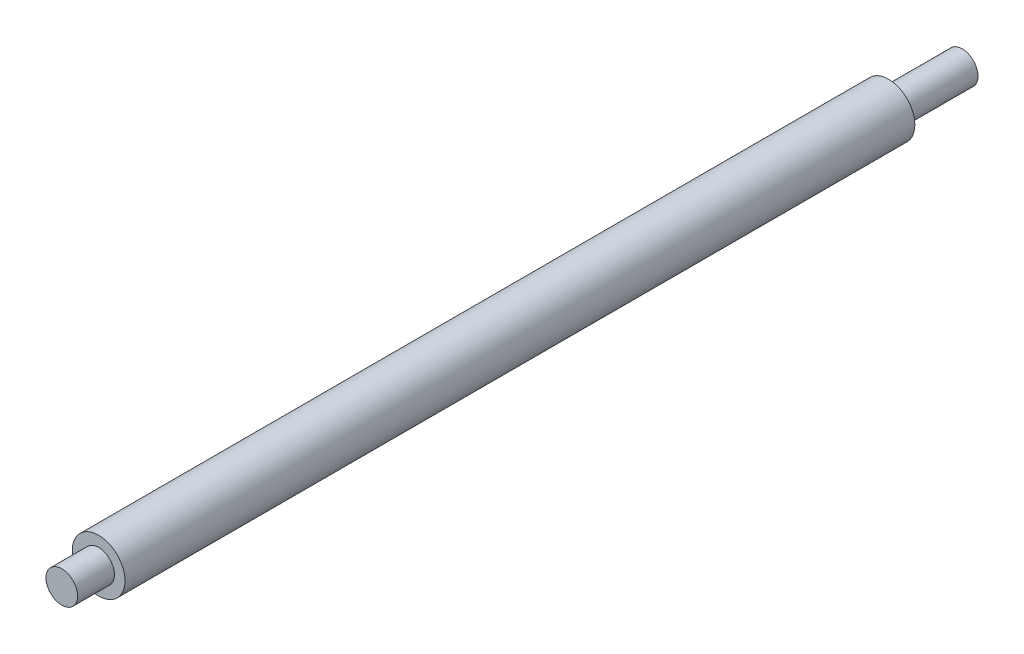
ISO-10303-21;
HEADER;
FILE_DESCRIPTION(('STEP AP214'),'2;1');
FILE_NAME('part.step','',(''),(''),'','','');
FILE_SCHEMA(('AUTOMOTIVE_DESIGN { 1 0 10303 214 1 1 1 1 }'));
ENDSEC;
DATA;
#1=APPLICATION_CONTEXT('core data for automotive mechanical design processes');
#2=APPLICATION_PROTOCOL_DEFINITION('international standard','automotive_design',2000,#1);
#3=PRODUCT_CONTEXT('',#1,'mechanical');
#4=PRODUCT('Part','Part','',(#3));
#5=PRODUCT_RELATED_PRODUCT_CATEGORY('part','',(#4));
#6=PRODUCT_DEFINITION_FORMATION('','',#4);
#7=PRODUCT_DEFINITION_CONTEXT('part definition',#1,'design');
#8=PRODUCT_DEFINITION('design','',#6,#7);
#9=PRODUCT_DEFINITION_SHAPE('','',#8);
#10=(LENGTH_UNIT() NAMED_UNIT(*) SI_UNIT(.MILLI.,.METRE.));
#11=(NAMED_UNIT(*) PLANE_ANGLE_UNIT() SI_UNIT($,.RADIAN.));
#12=(NAMED_UNIT(*) SI_UNIT($,.STERADIAN.) SOLID_ANGLE_UNIT());
#13=UNCERTAINTY_MEASURE_WITH_UNIT(LENGTH_MEASURE(1.E-05),#10,'distance_accuracy_value','');
#14=(GEOMETRIC_REPRESENTATION_CONTEXT(3) GLOBAL_UNCERTAINTY_ASSIGNED_CONTEXT((#13)) GLOBAL_UNIT_ASSIGNED_CONTEXT((#10,
#11,#12)) REPRESENTATION_CONTEXT('',''));
#15=CARTESIAN_POINT('',(0.,0.,0.));
#16=DIRECTION('',(0.,0.,1.));
#17=DIRECTION('',(1.,0.,0.));
#18=AXIS2_PLACEMENT_3D('',#15,#16,#17);
#19=CARTESIAN_POINT('',(0.,0.,750.));
#20=DIRECTION('',(0.,0.,-1.));
#21=DIRECTION('',(-1.,0.,0.));
#22=AXIS2_PLACEMENT_3D('',#19,#20,#21);
#23=CYLINDRICAL_SURFACE('',#22,25.);
#24=CARTESIAN_POINT('',(0.,0.,750.));
#25=DIRECTION('',(0.,0.,1.));
#26=DIRECTION('',(1.,0.,0.));
#27=AXIS2_PLACEMENT_3D('',#24,#25,#26);
#28=CIRCLE('',#27,25.);
#29=CARTESIAN_POINT('',(25.,0.,750.));
#30=VERTEX_POINT('',#29);
#31=EDGE_CURVE('E51',#30,#30,#28,.T.);
#32=ORIENTED_EDGE('',*,*,#31,.F.);
#33=EDGE_LOOP('',(#32));
#34=FACE_BOUND('',#33,.T.);
#35=CARTESIAN_POINT('',(0.,0.,0.));
#36=DIRECTION('',(0.,0.,1.));
#37=DIRECTION('',(1.,0.,0.));
#38=AXIS2_PLACEMENT_3D('',#35,#36,#37);
#39=CIRCLE('',#38,25.);
#40=CARTESIAN_POINT('',(25.,0.,0.));
#41=VERTEX_POINT('',#40);
#42=EDGE_CURVE('E40',#41,#41,#39,.T.);
#43=ORIENTED_EDGE('',*,*,#42,.T.);
#44=EDGE_LOOP('',(#43));
#45=FACE_BOUND('',#44,.T.);
#46=ADVANCED_FACE('F37',(#34,#45),#23,.T.);
#47=CARTESIAN_POINT('',(0.,0.,750.));
#48=DIRECTION('',(0.,0.,1.));
#49=DIRECTION('',(1.,0.,0.));
#50=AXIS2_PLACEMENT_3D('',#47,#48,#49);
#51=PLANE('',#50);
#52=CARTESIAN_POINT('',(0.,0.,750.));
#53=DIRECTION('',(0.,0.,1.));
#54=DIRECTION('',(1.,0.,0.));
#55=AXIS2_PLACEMENT_3D('',#52,#53,#54);
#56=CIRCLE('',#55,15.);
#57=CARTESIAN_POINT('',(15.,0.,750.));
#58=VERTEX_POINT('',#57);
#59=EDGE_CURVE('E10',#58,#58,#56,.T.);
#60=ORIENTED_EDGE('',*,*,#59,.F.);
#61=EDGE_LOOP('',(#60));
#62=FACE_BOUND('',#61,.T.);
#63=ORIENTED_EDGE('',*,*,#31,.T.);
#64=EDGE_LOOP('',(#63));
#65=FACE_BOUND('',#64,.T.);
#66=ADVANCED_FACE('F71',(#62,#65),#51,.T.);
#67=CARTESIAN_POINT('',(0.,0.,0.));
#68=DIRECTION('',(0.,0.,1.));
#69=DIRECTION('',(1.,0.,0.));
#70=AXIS2_PLACEMENT_3D('',#67,#68,#69);
#71=PLANE('',#70);
#72=CARTESIAN_POINT('',(0.,0.,0.));
#73=DIRECTION('',(0.,0.,-1.));
#74=DIRECTION('',(-1.,0.,0.));
#75=AXIS2_PLACEMENT_3D('',#72,#73,#74);
#76=CIRCLE('',#75,15.);
#77=CARTESIAN_POINT('',(-15.,0.,0.));
#78=VERTEX_POINT('',#77);
#79=EDGE_CURVE('E45',#78,#78,#76,.T.);
#80=ORIENTED_EDGE('',*,*,#79,.F.);
#81=EDGE_LOOP('',(#80));
#82=FACE_BOUND('',#81,.T.);
#83=ORIENTED_EDGE('',*,*,#42,.F.);
#84=EDGE_LOOP('',(#83));
#85=FACE_BOUND('',#84,.T.);
#86=ADVANCED_FACE('F68',(#82,#85),#71,.F.);
#87=CARTESIAN_POINT('',(0.,0.,-70.));
#88=DIRECTION('',(0.,0.,1.));
#89=DIRECTION('',(1.,0.,0.));
#90=AXIS2_PLACEMENT_3D('',#87,#88,#89);
#91=CYLINDRICAL_SURFACE('',#90,15.);
#92=CARTESIAN_POINT('',(0.,0.,-70.));
#93=DIRECTION('',(0.,0.,-1.));
#94=DIRECTION('',(-1.,0.,0.));
#95=AXIS2_PLACEMENT_3D('',#92,#93,#94);
#96=CIRCLE('',#95,15.);
#97=CARTESIAN_POINT('',(-15.,0.,-70.));
#98=VERTEX_POINT('',#97);
#99=EDGE_CURVE('E56',#98,#98,#96,.T.);
#100=ORIENTED_EDGE('',*,*,#99,.F.);
#101=EDGE_LOOP('',(#100));
#102=FACE_BOUND('',#101,.T.);
#103=ORIENTED_EDGE('',*,*,#79,.T.);
#104=EDGE_LOOP('',(#103));
#105=FACE_BOUND('',#104,.T.);
#106=ADVANCED_FACE('F70',(#102,#105),#91,.T.);
#107=CARTESIAN_POINT('',(0.,0.,-70.));
#108=DIRECTION('',(0.,0.,-1.));
#109=DIRECTION('',(-1.,0.,0.));
#110=AXIS2_PLACEMENT_3D('',#107,#108,#109);
#111=PLANE('',#110);
#112=ORIENTED_EDGE('',*,*,#99,.T.);
#113=EDGE_LOOP('',(#112));
#114=FACE_BOUND('',#113,.T.);
#115=ADVANCED_FACE('F77',(#114),#111,.T.);
#116=CARTESIAN_POINT('',(0.,0.,785.));
#117=DIRECTION('',(0.,0.,-1.));
#118=DIRECTION('',(-1.,0.,0.));
#119=AXIS2_PLACEMENT_3D('',#116,#117,#118);
#120=CYLINDRICAL_SURFACE('',#119,15.);
#121=CARTESIAN_POINT('',(0.,0.,785.));
#122=DIRECTION('',(0.,0.,1.));
#123=DIRECTION('',(1.,0.,0.));
#124=AXIS2_PLACEMENT_3D('',#121,#122,#123);
#125=CIRCLE('',#124,15.);
#126=CARTESIAN_POINT('',(15.,0.,785.));
#127=VERTEX_POINT('',#126);
#128=EDGE_CURVE('E55',#127,#127,#125,.T.);
#129=ORIENTED_EDGE('',*,*,#128,.F.);
#130=EDGE_LOOP('',(#129));
#131=FACE_BOUND('',#130,.T.);
#132=ORIENTED_EDGE('',*,*,#59,.T.);
#133=EDGE_LOOP('',(#132));
#134=FACE_BOUND('',#133,.T.);
#135=ADVANCED_FACE('F102',(#131,#134),#120,.T.);
#136=CARTESIAN_POINT('',(0.,0.,785.));
#137=DIRECTION('',(0.,0.,1.));
#138=DIRECTION('',(1.,0.,0.));
#139=AXIS2_PLACEMENT_3D('',#136,#137,#138);
#140=PLANE('',#139);
#141=ORIENTED_EDGE('',*,*,#128,.T.);
#142=EDGE_LOOP('',(#141));
#143=FACE_BOUND('',#142,.T.);
#144=ADVANCED_FACE('F107',(#143),#140,.T.);
#145=CLOSED_SHELL('',(#46,#66,#86,#106,#115,#135,#144));
#146=MANIFOLD_SOLID_BREP('B2',#145);
#147=ADVANCED_BREP_SHAPE_REPRESENTATION('',(#18,#146),#14);
#148=SHAPE_DEFINITION_REPRESENTATION(#9,#147);
ENDSEC;
END-ISO-10303-21;
